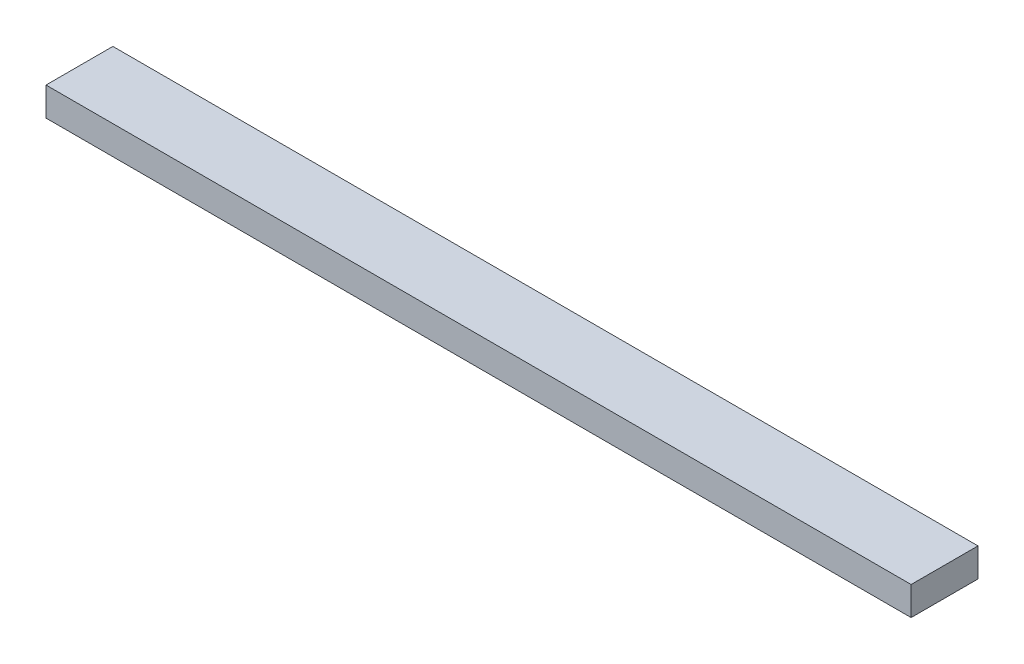
ISO-10303-21;
HEADER;
FILE_DESCRIPTION(('STEP AP214'),'2;1');
FILE_NAME('part.step','',(''),(''),'','','');
FILE_SCHEMA(('AUTOMOTIVE_DESIGN { 1 0 10303 214 1 1 1 1 }'));
ENDSEC;
DATA;
#1=APPLICATION_CONTEXT('core data for automotive mechanical design processes');
#2=APPLICATION_PROTOCOL_DEFINITION('international standard','automotive_design',2000,#1);
#3=PRODUCT_CONTEXT('',#1,'mechanical');
#4=PRODUCT('Part','Part','',(#3));
#5=PRODUCT_RELATED_PRODUCT_CATEGORY('part','',(#4));
#6=PRODUCT_DEFINITION_FORMATION('','',#4);
#7=PRODUCT_DEFINITION_CONTEXT('part definition',#1,'design');
#8=PRODUCT_DEFINITION('design','',#6,#7);
#9=PRODUCT_DEFINITION_SHAPE('','',#8);
#10=(LENGTH_UNIT() NAMED_UNIT(*) SI_UNIT(.MILLI.,.METRE.));
#11=(NAMED_UNIT(*) PLANE_ANGLE_UNIT() SI_UNIT($,.RADIAN.));
#12=(NAMED_UNIT(*) SI_UNIT($,.STERADIAN.) SOLID_ANGLE_UNIT());
#13=UNCERTAINTY_MEASURE_WITH_UNIT(LENGTH_MEASURE(1.E-05),#10,'distance_accuracy_value','');
#14=(GEOMETRIC_REPRESENTATION_CONTEXT(3) GLOBAL_UNCERTAINTY_ASSIGNED_CONTEXT((#13)) GLOBAL_UNIT_ASSIGNED_CONTEXT((#10,
#11,#12)) REPRESENTATION_CONTEXT('',''));
#15=CARTESIAN_POINT('',(0.,0.,0.));
#16=DIRECTION('',(0.,0.,1.));
#17=DIRECTION('',(1.,0.,0.));
#18=AXIS2_PLACEMENT_3D('',#15,#16,#17);
#19=CARTESIAN_POINT('',(3.32166911111995E-13,38.1,88.9000000000001));
#20=DIRECTION('',(1.,0.,0.));
#21=DIRECTION('',(0.,0.,-1.));
#22=AXIS2_PLACEMENT_3D('',#19,#20,#21);
#23=PLANE('',#22);
#24=DIRECTION('',(0.,0.,1.));
#25=VECTOR('',#24,1.);
#26=CARTESIAN_POINT('',(3.32166911111995E-13,0.,88.9000000000001));
#27=LINE('',#26,#25);
#28=CARTESIAN_POINT('',(0.,0.,0.));
#29=VERTEX_POINT('',#28);
#30=CARTESIAN_POINT('',(3.32166911111995E-13,0.,88.9000000000001));
#31=VERTEX_POINT('',#30);
#32=EDGE_CURVE('E102',#29,#31,#27,.T.);
#33=ORIENTED_EDGE('',*,*,#32,.T.);
#34=DIRECTION('',(0.,-1.,0.));
#35=VECTOR('',#34,1.);
#36=CARTESIAN_POINT('',(3.32166911111995E-13,38.1,88.9000000000001));
#37=LINE('',#36,#35);
#38=CARTESIAN_POINT('',(3.32166911111995E-13,38.1,88.9000000000001));
#39=VERTEX_POINT('',#38);
#40=EDGE_CURVE('E11',#39,#31,#37,.T.);
#41=ORIENTED_EDGE('',*,*,#40,.F.);
#42=DIRECTION('',(0.,0.,1.));
#43=VECTOR('',#42,1.);
#44=CARTESIAN_POINT('',(3.32166911111995E-13,38.1,88.9000000000001));
#45=LINE('',#44,#43);
#46=CARTESIAN_POINT('',(0.,38.1,0.));
#47=VERTEX_POINT('',#46);
#48=EDGE_CURVE('E90',#47,#39,#45,.T.);
#49=ORIENTED_EDGE('',*,*,#48,.F.);
#50=DIRECTION('',(0.,-1.,0.));
#51=VECTOR('',#50,1.);
#52=CARTESIAN_POINT('',(0.,38.1,0.));
#53=LINE('',#52,#51);
#54=EDGE_CURVE('E98',#47,#29,#53,.T.);
#55=ORIENTED_EDGE('',*,*,#54,.T.);
#56=EDGE_LOOP('',(#33,#41,#49,#55));
#57=FACE_BOUND('',#56,.T.);
#58=ADVANCED_FACE('F39',(#57),#23,.F.);
#59=CARTESIAN_POINT('',(1150.,38.1,88.9));
#60=DIRECTION('',(0.,0.,-1.));
#61=DIRECTION('',(-1.,0.,0.));
#62=AXIS2_PLACEMENT_3D('',#59,#60,#61);
#63=PLANE('',#62);
#64=DIRECTION('',(1.,0.,0.));
#65=VECTOR('',#64,1.);
#66=CARTESIAN_POINT('',(1150.,0.,88.9));
#67=LINE('',#66,#65);
#68=CARTESIAN_POINT('',(1150.,0.,88.9));
#69=VERTEX_POINT('',#68);
#70=EDGE_CURVE('E94',#31,#69,#67,.T.);
#71=ORIENTED_EDGE('',*,*,#70,.T.);
#72=DIRECTION('',(0.,-1.,0.));
#73=VECTOR('',#72,1.);
#74=CARTESIAN_POINT('',(1150.,38.1,88.9));
#75=LINE('',#74,#73);
#76=CARTESIAN_POINT('',(1150.,38.1,88.9));
#77=VERTEX_POINT('',#76);
#78=EDGE_CURVE('E47',#77,#69,#75,.T.);
#79=ORIENTED_EDGE('',*,*,#78,.F.);
#80=DIRECTION('',(1.,0.,0.));
#81=VECTOR('',#80,1.);
#82=CARTESIAN_POINT('',(1150.,38.1,88.9));
#83=LINE('',#82,#81);
#84=EDGE_CURVE('E85',#39,#77,#83,.T.);
#85=ORIENTED_EDGE('',*,*,#84,.F.);
#86=ORIENTED_EDGE('',*,*,#40,.T.);
#87=EDGE_LOOP('',(#71,#79,#85,#86));
#88=FACE_BOUND('',#87,.T.);
#89=ADVANCED_FACE('F93',(#88),#63,.F.);
#90=CARTESIAN_POINT('',(1150.,38.1,0.));
#91=DIRECTION('',(-1.,0.,0.));
#92=DIRECTION('',(0.,0.,1.));
#93=AXIS2_PLACEMENT_3D('',#90,#91,#92);
#94=PLANE('',#93);
#95=DIRECTION('',(0.,0.,-1.));
#96=VECTOR('',#95,1.);
#97=CARTESIAN_POINT('',(1150.,0.,0.));
#98=LINE('',#97,#96);
#99=CARTESIAN_POINT('',(1150.,0.,0.));
#100=VERTEX_POINT('',#99);
#101=EDGE_CURVE('E72',#69,#100,#98,.T.);
#102=ORIENTED_EDGE('',*,*,#101,.T.);
#103=DIRECTION('',(0.,-1.,0.));
#104=VECTOR('',#103,1.);
#105=CARTESIAN_POINT('',(1150.,38.1,0.));
#106=LINE('',#105,#104);
#107=CARTESIAN_POINT('',(1150.,38.1,0.));
#108=VERTEX_POINT('',#107);
#109=EDGE_CURVE('E95',#108,#100,#106,.T.);
#110=ORIENTED_EDGE('',*,*,#109,.F.);
#111=DIRECTION('',(0.,0.,-1.));
#112=VECTOR('',#111,1.);
#113=CARTESIAN_POINT('',(1150.,38.1,0.));
#114=LINE('',#113,#112);
#115=EDGE_CURVE('E88',#77,#108,#114,.T.);
#116=ORIENTED_EDGE('',*,*,#115,.F.);
#117=ORIENTED_EDGE('',*,*,#78,.T.);
#118=EDGE_LOOP('',(#102,#110,#116,#117));
#119=FACE_BOUND('',#118,.T.);
#120=ADVANCED_FACE('F96',(#119),#94,.F.);
#121=CARTESIAN_POINT('',(0.,38.1,0.));
#122=DIRECTION('',(0.,0.,1.));
#123=DIRECTION('',(1.,0.,0.));
#124=AXIS2_PLACEMENT_3D('',#121,#122,#123);
#125=PLANE('',#124);
#126=DIRECTION('',(-1.,0.,0.));
#127=VECTOR('',#126,1.);
#128=CARTESIAN_POINT('',(0.,0.,0.));
#129=LINE('',#128,#127);
#130=EDGE_CURVE('E78',#100,#29,#129,.T.);
#131=ORIENTED_EDGE('',*,*,#130,.T.);
#132=ORIENTED_EDGE('',*,*,#54,.F.);
#133=DIRECTION('',(-1.,0.,0.));
#134=VECTOR('',#133,1.);
#135=CARTESIAN_POINT('',(0.,38.1,0.));
#136=LINE('',#135,#134);
#137=EDGE_CURVE('E55',#108,#47,#136,.T.);
#138=ORIENTED_EDGE('',*,*,#137,.F.);
#139=ORIENTED_EDGE('',*,*,#109,.T.);
#140=EDGE_LOOP('',(#131,#132,#138,#139));
#141=FACE_BOUND('',#140,.T.);
#142=ADVANCED_FACE('F109',(#141),#125,.F.);
#143=CARTESIAN_POINT('',(0.,38.1,0.));
#144=DIRECTION('',(0.,-1.,0.));
#145=DIRECTION('',(0.,0.,-1.));
#146=AXIS2_PLACEMENT_3D('',#143,#144,#145);
#147=PLANE('',#146);
#148=ORIENTED_EDGE('',*,*,#48,.T.);
#149=ORIENTED_EDGE('',*,*,#84,.T.);
#150=ORIENTED_EDGE('',*,*,#115,.T.);
#151=ORIENTED_EDGE('',*,*,#137,.T.);
#152=EDGE_LOOP('',(#148,#149,#150,#151));
#153=FACE_BOUND('',#152,.T.);
#154=ADVANCED_FACE('F86',(#153),#147,.F.);
#155=CARTESIAN_POINT('',(0.,0.,0.));
#156=DIRECTION('',(0.,-1.,0.));
#157=DIRECTION('',(0.,0.,-1.));
#158=AXIS2_PLACEMENT_3D('',#155,#156,#157);
#159=PLANE('',#158);
#160=ORIENTED_EDGE('',*,*,#32,.F.);
#161=ORIENTED_EDGE('',*,*,#130,.F.);
#162=ORIENTED_EDGE('',*,*,#101,.F.);
#163=ORIENTED_EDGE('',*,*,#70,.F.);
#164=EDGE_LOOP('',(#160,#161,#162,#163));
#165=FACE_BOUND('',#164,.T.);
#166=ADVANCED_FACE('F112',(#165),#159,.T.);
#167=CLOSED_SHELL('',(#58,#89,#120,#142,#154,#166));
#168=MANIFOLD_SOLID_BREP('B2',#167);
#169=ADVANCED_BREP_SHAPE_REPRESENTATION('',(#18,#168),#14);
#170=SHAPE_DEFINITION_REPRESENTATION(#9,#169);
ENDSEC;
END-ISO-10303-21;
